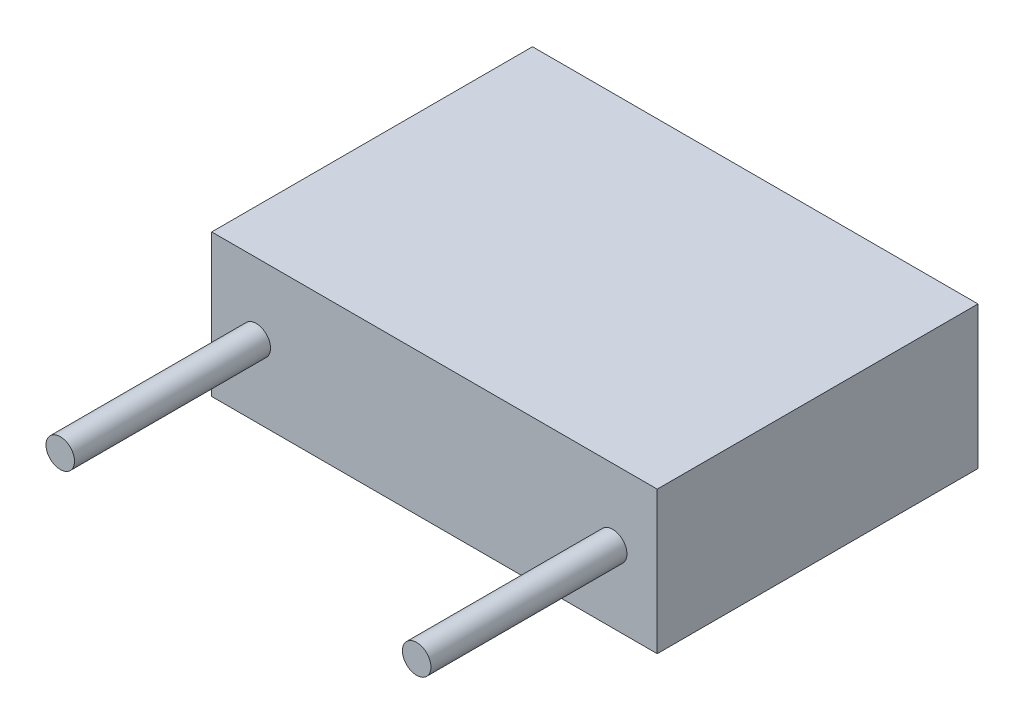
ISO-10303-21;
HEADER;
FILE_DESCRIPTION(('STEP AP214'),'2;1');
FILE_NAME('part.step','',(''),(''),'','','');
FILE_SCHEMA(('AUTOMOTIVE_DESIGN { 1 0 10303 214 1 1 1 1 }'));
ENDSEC;
DATA;
#1=APPLICATION_CONTEXT('core data for automotive mechanical design processes');
#2=APPLICATION_PROTOCOL_DEFINITION('international standard','automotive_design',2000,#1);
#3=PRODUCT_CONTEXT('',#1,'mechanical');
#4=PRODUCT('Part','Part','',(#3));
#5=PRODUCT_RELATED_PRODUCT_CATEGORY('part','',(#4));
#6=PRODUCT_DEFINITION_FORMATION('','',#4);
#7=PRODUCT_DEFINITION_CONTEXT('part definition',#1,'design');
#8=PRODUCT_DEFINITION('design','',#6,#7);
#9=PRODUCT_DEFINITION_SHAPE('','',#8);
#10=(LENGTH_UNIT() NAMED_UNIT(*) SI_UNIT(.MILLI.,.METRE.));
#11=(NAMED_UNIT(*) PLANE_ANGLE_UNIT() SI_UNIT($,.RADIAN.));
#12=(NAMED_UNIT(*) SI_UNIT($,.STERADIAN.) SOLID_ANGLE_UNIT());
#13=UNCERTAINTY_MEASURE_WITH_UNIT(LENGTH_MEASURE(1.E-05),#10,'distance_accuracy_value','');
#14=(GEOMETRIC_REPRESENTATION_CONTEXT(3) GLOBAL_UNCERTAINTY_ASSIGNED_CONTEXT((#13)) GLOBAL_UNIT_ASSIGNED_CONTEXT((#10,
#11,#12)) REPRESENTATION_CONTEXT('',''));
#15=CARTESIAN_POINT('',(0.,0.,0.));
#16=DIRECTION('',(0.,0.,1.));
#17=DIRECTION('',(1.,0.,0.));
#18=AXIS2_PLACEMENT_3D('',#15,#16,#17);
#19=CARTESIAN_POINT('',(0.,4.,9.));
#20=DIRECTION('',(0.,0.,-1.));
#21=DIRECTION('',(-1.,0.,0.));
#22=AXIS2_PLACEMENT_3D('',#19,#20,#21);
#23=PLANE('',#22);
#24=CARTESIAN_POINT('',(1.25,2.,9.));
#25=DIRECTION('',(0.,0.,-1.));
#26=DIRECTION('',(-1.,0.,0.));
#27=AXIS2_PLACEMENT_3D('',#24,#25,#26);
#28=CIRCLE('',#27,0.4);
#29=CARTESIAN_POINT('',(0.849999999999999,2.,9.));
#30=VERTEX_POINT('',#29);
#31=EDGE_CURVE('E42',#30,#30,#28,.F.);
#32=ORIENTED_EDGE('',*,*,#31,.F.);
#33=EDGE_LOOP('',(#32));
#34=FACE_BOUND('',#33,.T.);
#35=DIRECTION('',(0.,-1.,0.));
#36=VECTOR('',#35,1.);
#37=CARTESIAN_POINT('',(0.,0.,9.));
#38=LINE('',#37,#36);
#39=CARTESIAN_POINT('',(0.,4.,9.));
#40=VERTEX_POINT('',#39);
#41=CARTESIAN_POINT('',(0.,0.,9.));
#42=VERTEX_POINT('',#41);
#43=EDGE_CURVE('E86',#40,#42,#38,.T.);
#44=ORIENTED_EDGE('',*,*,#43,.T.);
#45=DIRECTION('',(1.,0.,0.));
#46=VECTOR('',#45,1.);
#47=CARTESIAN_POINT('',(0.,0.,9.));
#48=LINE('',#47,#46);
#49=CARTESIAN_POINT('',(12.5,0.,9.));
#50=VERTEX_POINT('',#49);
#51=EDGE_CURVE('E81',#42,#50,#48,.T.);
#52=ORIENTED_EDGE('',*,*,#51,.T.);
#53=DIRECTION('',(0.,1.,0.));
#54=VECTOR('',#53,1.);
#55=CARTESIAN_POINT('',(12.5,0.,9.));
#56=LINE('',#55,#54);
#57=CARTESIAN_POINT('',(12.5,4.,9.));
#58=VERTEX_POINT('',#57);
#59=EDGE_CURVE('E84',#50,#58,#56,.T.);
#60=ORIENTED_EDGE('',*,*,#59,.T.);
#61=DIRECTION('',(-1.,0.,0.));
#62=VECTOR('',#61,1.);
#63=CARTESIAN_POINT('',(0.,4.,9.));
#64=LINE('',#63,#62);
#65=EDGE_CURVE('E50',#58,#40,#64,.T.);
#66=ORIENTED_EDGE('',*,*,#65,.T.);
#67=EDGE_LOOP('',(#44,#52,#60,#66));
#68=FACE_BOUND('',#67,.T.);
#69=CARTESIAN_POINT('',(11.25,2.,9.));
#70=DIRECTION('',(0.,0.,-1.));
#71=DIRECTION('',(-1.,0.,0.));
#72=AXIS2_PLACEMENT_3D('',#69,#70,#71);
#73=CIRCLE('',#72,0.399999999999999);
#74=CARTESIAN_POINT('',(10.85,2.,9.));
#75=VERTEX_POINT('',#74);
#76=EDGE_CURVE('E11',#75,#75,#73,.F.);
#77=ORIENTED_EDGE('',*,*,#76,.F.);
#78=EDGE_LOOP('',(#77));
#79=FACE_BOUND('',#78,.T.);
#80=ADVANCED_FACE('F33',(#34,#68,#79),#23,.F.);
#81=CARTESIAN_POINT('',(0.,0.,9.));
#82=DIRECTION('',(1.,0.,0.));
#83=DIRECTION('',(0.,0.,-1.));
#84=AXIS2_PLACEMENT_3D('',#81,#82,#83);
#85=PLANE('',#84);
#86=DIRECTION('',(0.,-1.,0.));
#87=VECTOR('',#86,1.);
#88=CARTESIAN_POINT('',(0.,0.,0.));
#89=LINE('',#88,#87);
#90=CARTESIAN_POINT('',(0.,4.,0.));
#91=VERTEX_POINT('',#90);
#92=CARTESIAN_POINT('',(0.,0.,0.));
#93=VERTEX_POINT('',#92);
#94=EDGE_CURVE('E101',#91,#93,#89,.T.);
#95=ORIENTED_EDGE('',*,*,#94,.T.);
#96=DIRECTION('',(0.,0.,-1.));
#97=VECTOR('',#96,1.);
#98=CARTESIAN_POINT('',(0.,0.,9.));
#99=LINE('',#98,#97);
#100=EDGE_CURVE('E92',#42,#93,#99,.T.);
#101=ORIENTED_EDGE('',*,*,#100,.F.);
#102=ORIENTED_EDGE('',*,*,#43,.F.);
#103=DIRECTION('',(0.,0.,-1.));
#104=VECTOR('',#103,1.);
#105=CARTESIAN_POINT('',(0.,4.,9.));
#106=LINE('',#105,#104);
#107=EDGE_CURVE('E97',#40,#91,#106,.T.);
#108=ORIENTED_EDGE('',*,*,#107,.T.);
#109=EDGE_LOOP('',(#95,#101,#102,#108));
#110=FACE_BOUND('',#109,.T.);
#111=ADVANCED_FACE('F35',(#110),#85,.F.);
#112=CARTESIAN_POINT('',(0.,0.,9.));
#113=DIRECTION('',(0.,1.,0.));
#114=DIRECTION('',(0.,0.,1.));
#115=AXIS2_PLACEMENT_3D('',#112,#113,#114);
#116=PLANE('',#115);
#117=DIRECTION('',(1.,0.,0.));
#118=VECTOR('',#117,1.);
#119=CARTESIAN_POINT('',(0.,0.,0.));
#120=LINE('',#119,#118);
#121=CARTESIAN_POINT('',(12.5,0.,0.));
#122=VERTEX_POINT('',#121);
#123=EDGE_CURVE('E91',#93,#122,#120,.T.);
#124=ORIENTED_EDGE('',*,*,#123,.T.);
#125=DIRECTION('',(0.,0.,-1.));
#126=VECTOR('',#125,1.);
#127=CARTESIAN_POINT('',(12.5,0.,9.));
#128=LINE('',#127,#126);
#129=EDGE_CURVE('E89',#50,#122,#128,.T.);
#130=ORIENTED_EDGE('',*,*,#129,.F.);
#131=ORIENTED_EDGE('',*,*,#51,.F.);
#132=ORIENTED_EDGE('',*,*,#100,.T.);
#133=EDGE_LOOP('',(#124,#130,#131,#132));
#134=FACE_BOUND('',#133,.T.);
#135=ADVANCED_FACE('F90',(#134),#116,.F.);
#136=CARTESIAN_POINT('',(12.5,0.,9.));
#137=DIRECTION('',(-1.,0.,0.));
#138=DIRECTION('',(0.,0.,1.));
#139=AXIS2_PLACEMENT_3D('',#136,#137,#138);
#140=PLANE('',#139);
#141=DIRECTION('',(0.,1.,0.));
#142=VECTOR('',#141,1.);
#143=CARTESIAN_POINT('',(12.5,0.,0.));
#144=LINE('',#143,#142);
#145=CARTESIAN_POINT('',(12.5,4.,0.));
#146=VERTEX_POINT('',#145);
#147=EDGE_CURVE('E67',#122,#146,#144,.T.);
#148=ORIENTED_EDGE('',*,*,#147,.T.);
#149=DIRECTION('',(0.,0.,-1.));
#150=VECTOR('',#149,1.);
#151=CARTESIAN_POINT('',(12.5,4.,9.));
#152=LINE('',#151,#150);
#153=EDGE_CURVE('E93',#58,#146,#152,.T.);
#154=ORIENTED_EDGE('',*,*,#153,.F.);
#155=ORIENTED_EDGE('',*,*,#59,.F.);
#156=ORIENTED_EDGE('',*,*,#129,.T.);
#157=EDGE_LOOP('',(#148,#154,#155,#156));
#158=FACE_BOUND('',#157,.T.);
#159=ADVANCED_FACE('F95',(#158),#140,.F.);
#160=CARTESIAN_POINT('',(0.,4.,9.));
#161=DIRECTION('',(0.,-1.,0.));
#162=DIRECTION('',(0.,0.,-1.));
#163=AXIS2_PLACEMENT_3D('',#160,#161,#162);
#164=PLANE('',#163);
#165=DIRECTION('',(-1.,0.,0.));
#166=VECTOR('',#165,1.);
#167=CARTESIAN_POINT('',(0.,4.,0.));
#168=LINE('',#167,#166);
#169=EDGE_CURVE('E73',#146,#91,#168,.T.);
#170=ORIENTED_EDGE('',*,*,#169,.T.);
#171=ORIENTED_EDGE('',*,*,#107,.F.);
#172=ORIENTED_EDGE('',*,*,#65,.F.);
#173=ORIENTED_EDGE('',*,*,#153,.T.);
#174=EDGE_LOOP('',(#170,#171,#172,#173));
#175=FACE_BOUND('',#174,.T.);
#176=ADVANCED_FACE('F127',(#175),#164,.F.);
#177=CARTESIAN_POINT('',(0.,4.,0.));
#178=DIRECTION('',(0.,0.,-1.));
#179=DIRECTION('',(-1.,0.,0.));
#180=AXIS2_PLACEMENT_3D('',#177,#178,#179);
#181=PLANE('',#180);
#182=ORIENTED_EDGE('',*,*,#94,.F.);
#183=ORIENTED_EDGE('',*,*,#169,.F.);
#184=ORIENTED_EDGE('',*,*,#147,.F.);
#185=ORIENTED_EDGE('',*,*,#123,.F.);
#186=EDGE_LOOP('',(#182,#183,#184,#185));
#187=FACE_BOUND('',#186,.T.);
#188=ADVANCED_FACE('F124',(#187),#181,.T.);
#189=CARTESIAN_POINT('',(1.25,2.,14.5));
#190=DIRECTION('',(0.,0.,-1.));
#191=DIRECTION('',(-1.,0.,0.));
#192=AXIS2_PLACEMENT_3D('',#189,#190,#191);
#193=CYLINDRICAL_SURFACE('',#192,0.4);
#194=CARTESIAN_POINT('',(1.25,2.,14.5));
#195=DIRECTION('',(0.,0.,1.));
#196=DIRECTION('',(1.,0.,0.));
#197=AXIS2_PLACEMENT_3D('',#194,#195,#196);
#198=CIRCLE('',#197,0.4);
#199=CARTESIAN_POINT('',(1.65,2.,14.5));
#200=VERTEX_POINT('',#199);
#201=EDGE_CURVE('E104',#200,#200,#198,.T.);
#202=ORIENTED_EDGE('',*,*,#201,.F.);
#203=EDGE_LOOP('',(#202));
#204=FACE_BOUND('',#203,.T.);
#205=ORIENTED_EDGE('',*,*,#31,.T.);
#206=EDGE_LOOP('',(#205));
#207=FACE_BOUND('',#206,.T.);
#208=ADVANCED_FACE('F113',(#204,#207),#193,.T.);
#209=CARTESIAN_POINT('',(1.25,2.,14.5));
#210=DIRECTION('',(0.,0.,1.));
#211=DIRECTION('',(1.,0.,0.));
#212=AXIS2_PLACEMENT_3D('',#209,#210,#211);
#213=PLANE('',#212);
#214=ORIENTED_EDGE('',*,*,#201,.T.);
#215=EDGE_LOOP('',(#214));
#216=FACE_BOUND('',#215,.T.);
#217=ADVANCED_FACE('F155',(#216),#213,.T.);
#218=CARTESIAN_POINT('',(11.25,2.,14.5));
#219=DIRECTION('',(0.,0.,-1.));
#220=DIRECTION('',(-1.,0.,0.));
#221=AXIS2_PLACEMENT_3D('',#218,#219,#220);
#222=CYLINDRICAL_SURFACE('',#221,0.399999999999999);
#223=CARTESIAN_POINT('',(11.25,2.,14.5));
#224=DIRECTION('',(0.,0.,1.));
#225=DIRECTION('',(1.,0.,0.));
#226=AXIS2_PLACEMENT_3D('',#223,#224,#225);
#227=CIRCLE('',#226,0.399999999999999);
#228=CARTESIAN_POINT('',(11.65,2.,14.5));
#229=VERTEX_POINT('',#228);
#230=EDGE_CURVE('E216',#229,#229,#227,.T.);
#231=ORIENTED_EDGE('',*,*,#230,.F.);
#232=EDGE_LOOP('',(#231));
#233=FACE_BOUND('',#232,.T.);
#234=ORIENTED_EDGE('',*,*,#76,.T.);
#235=EDGE_LOOP('',(#234));
#236=FACE_BOUND('',#235,.T.);
#237=ADVANCED_FACE('F162',(#233,#236),#222,.T.);
#238=CARTESIAN_POINT('',(11.25,2.,14.5));
#239=DIRECTION('',(0.,0.,1.));
#240=DIRECTION('',(1.,0.,0.));
#241=AXIS2_PLACEMENT_3D('',#238,#239,#240);
#242=PLANE('',#241);
#243=ORIENTED_EDGE('',*,*,#230,.T.);
#244=EDGE_LOOP('',(#243));
#245=FACE_BOUND('',#244,.T.);
#246=ADVANCED_FACE('F169',(#245),#242,.T.);
#247=CLOSED_SHELL('',(#80,#111,#135,#159,#176,#188,#208,#217,#237,#246));
#248=MANIFOLD_SOLID_BREP('B2',#247);
#249=ADVANCED_BREP_SHAPE_REPRESENTATION('',(#18,#248),#14);
#250=SHAPE_DEFINITION_REPRESENTATION(#9,#249);
ENDSEC;
END-ISO-10303-21;
